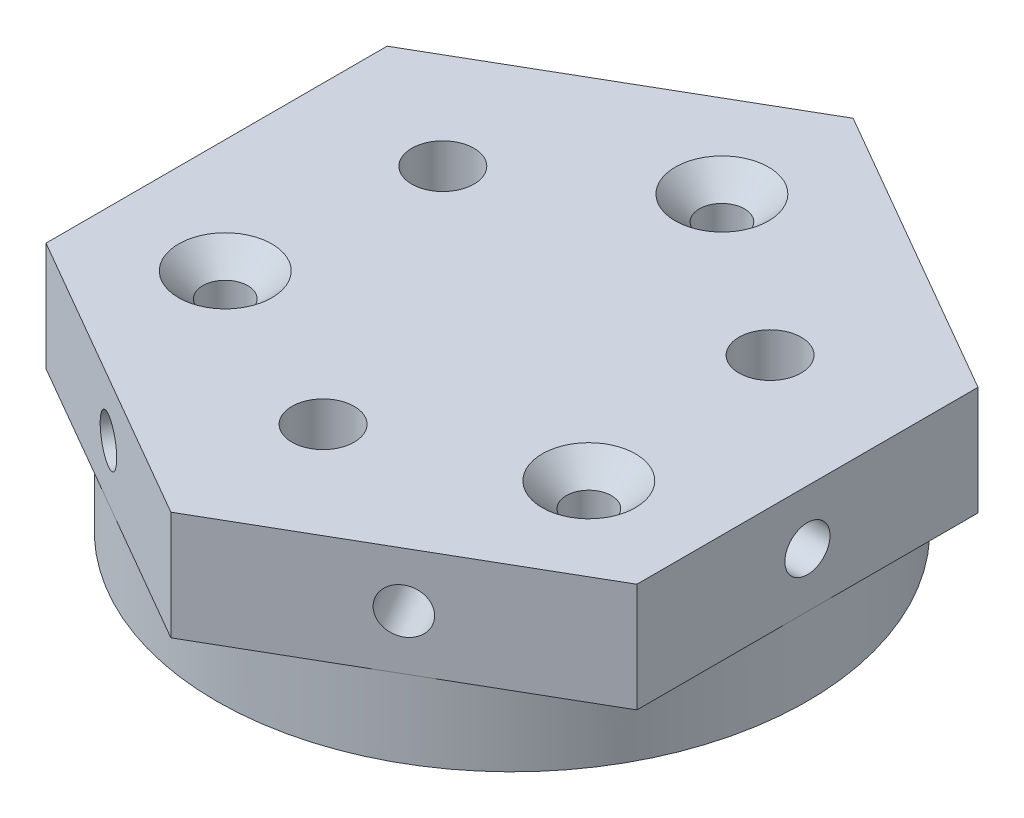
ISO-10303-21;
HEADER;
FILE_DESCRIPTION(('STEP AP214'),'2;1');
FILE_NAME('part.step','',(''),(''),'','','');
FILE_SCHEMA(('AUTOMOTIVE_DESIGN { 1 0 10303 214 1 1 1 1 }'));
ENDSEC;
DATA;
#1=APPLICATION_CONTEXT('core data for automotive mechanical design processes');
#2=APPLICATION_PROTOCOL_DEFINITION('international standard','automotive_design',2000,#1);
#3=PRODUCT_CONTEXT('',#1,'mechanical');
#4=PRODUCT('Part','Part','',(#3));
#5=PRODUCT_RELATED_PRODUCT_CATEGORY('part','',(#4));
#6=PRODUCT_DEFINITION_FORMATION('','',#4);
#7=PRODUCT_DEFINITION_CONTEXT('part definition',#1,'design');
#8=PRODUCT_DEFINITION('design','',#6,#7);
#9=PRODUCT_DEFINITION_SHAPE('','',#8);
#10=(LENGTH_UNIT() NAMED_UNIT(*) SI_UNIT(.MILLI.,.METRE.));
#11=(NAMED_UNIT(*) PLANE_ANGLE_UNIT() SI_UNIT($,.RADIAN.));
#12=(NAMED_UNIT(*) SI_UNIT($,.STERADIAN.) SOLID_ANGLE_UNIT());
#13=UNCERTAINTY_MEASURE_WITH_UNIT(LENGTH_MEASURE(1.E-05),#10,'distance_accuracy_value','');
#14=(GEOMETRIC_REPRESENTATION_CONTEXT(3) GLOBAL_UNCERTAINTY_ASSIGNED_CONTEXT((#13)) GLOBAL_UNIT_ASSIGNED_CONTEXT((#10,
#11,#12)) REPRESENTATION_CONTEXT('',''));
#15=CARTESIAN_POINT('',(0.,0.,0.));
#16=DIRECTION('',(0.,0.,1.));
#17=DIRECTION('',(1.,0.,0.));
#18=AXIS2_PLACEMENT_3D('',#15,#16,#17);
#19=CARTESIAN_POINT('',(-14.25,8.5,-24.6817240078565));
#20=DIRECTION('',(0.500000000000001,0.,0.866025403784438));
#21=DIRECTION('',(0.866025403784438,0.,-0.500000000000001));
#22=AXIS2_PLACEMENT_3D('',#19,#20,#21);
#23=CYLINDRICAL_SURFACE('',#22,1.45);
#24=CARTESIAN_POINT('',(9.50000000000001,8.5,16.4544826719043));
#25=DIRECTION('',(0.5,0.,0.866025403784438));
#26=DIRECTION('',(0.866025403784438,0.,-0.5));
#27=AXIS2_PLACEMENT_3D('',#24,#25,#26);
#28=CIRCLE('',#27,1.45);
#29=CARTESIAN_POINT('',(10.7557368354874,8.5,15.7294826719043));
#30=VERTEX_POINT('',#29);
#31=EDGE_CURVE('E169',#30,#30,#28,.T.);
#32=ORIENTED_EDGE('',*,*,#31,.T.);
#33=EDGE_LOOP('',(#32));
#34=FACE_BOUND('',#33,.T.);
#35=CARTESIAN_POINT('',(0.,8.5,0.));
#36=DIRECTION('',(1.,0.,0.));
#37=DIRECTION('',(0.,0.,1.));
#38=AXIS2_PLACEMENT_3D('',#35,#36,#37);
#39=ELLIPSE('',#38,2.9,1.45);
#40=CARTESIAN_POINT('',(0.,7.05,0.));
#41=VERTEX_POINT('',#40);
#42=CARTESIAN_POINT('',(0.,9.95,0.));
#43=VERTEX_POINT('',#42);
#44=EDGE_CURVE('E146',#41,#43,#39,.F.);
#45=ORIENTED_EDGE('',*,*,#44,.T.);
#46=CARTESIAN_POINT('',(0.,8.5,0.));
#47=DIRECTION('',(-0.5,0.,0.866025403784439));
#48=DIRECTION('',(0.866025403784439,0.,0.5));
#49=AXIS2_PLACEMENT_3D('',#46,#47,#48);
#50=ELLIPSE('',#49,2.9,1.45);
#51=EDGE_CURVE('E134',#43,#41,#50,.F.);
#52=ORIENTED_EDGE('',*,*,#51,.T.);
#53=EDGE_LOOP('',(#45,#52));
#54=FACE_BOUND('',#53,.T.);
#55=ADVANCED_FACE('F40',(#34,#54),#23,.F.);
#56=CARTESIAN_POINT('',(0.,12.,0.));
#57=DIRECTION('',(0.,-1.,0.));
#58=DIRECTION('',(0.,0.,-1.));
#59=AXIS2_PLACEMENT_3D('',#56,#57,#58);
#60=CYLINDRICAL_SURFACE('',#59,19.);
#61=CARTESIAN_POINT('',(0.,0.,0.));
#62=DIRECTION('',(0.,1.,0.));
#63=DIRECTION('',(0.,0.,1.));
#64=AXIS2_PLACEMENT_3D('',#61,#62,#63);
#65=CIRCLE('',#64,19.);
#66=CARTESIAN_POINT('',(0.,0.,19.));
#67=VERTEX_POINT('',#66);
#68=EDGE_CURVE('E151',#67,#67,#65,.T.);
#69=ORIENTED_EDGE('',*,*,#68,.T.);
#70=EDGE_LOOP('',(#69));
#71=FACE_BOUND('',#70,.T.);
#72=CARTESIAN_POINT('',(0.,5.,0.));
#73=DIRECTION('',(0.,1.,0.));
#74=DIRECTION('',(0.,0.,1.));
#75=AXIS2_PLACEMENT_3D('',#72,#73,#74);
#76=CIRCLE('',#75,19.);
#77=CARTESIAN_POINT('',(9.50000000000001,5.,16.4544826719043));
#78=VERTEX_POINT('',#77);
#79=CARTESIAN_POINT('',(19.,5.,0.));
#80=VERTEX_POINT('',#79);
#81=EDGE_CURVE('E251',#78,#80,#76,.T.);
#82=ORIENTED_EDGE('',*,*,#81,.F.);
#83=CARTESIAN_POINT('',(-9.50000000000001,5.,16.4544826719043));
#84=VERTEX_POINT('',#83);
#85=EDGE_CURVE('E227',#84,#78,#76,.T.);
#86=ORIENTED_EDGE('',*,*,#85,.F.);
#87=CARTESIAN_POINT('',(-19.,5.,0.));
#88=VERTEX_POINT('',#87);
#89=EDGE_CURVE('E250',#88,#84,#76,.T.);
#90=ORIENTED_EDGE('',*,*,#89,.F.);
#91=CARTESIAN_POINT('',(-9.5,5.,-16.4544826719043));
#92=VERTEX_POINT('',#91);
#93=EDGE_CURVE('E385',#92,#88,#76,.T.);
#94=ORIENTED_EDGE('',*,*,#93,.F.);
#95=CARTESIAN_POINT('',(9.5,5.,-16.4544826719043));
#96=VERTEX_POINT('',#95);
#97=EDGE_CURVE('E387',#96,#92,#76,.T.);
#98=ORIENTED_EDGE('',*,*,#97,.F.);
#99=EDGE_CURVE('E64',#80,#96,#76,.T.);
#100=ORIENTED_EDGE('',*,*,#99,.F.);
#101=EDGE_LOOP('',(#82,#86,#90,#94,#98,#100));
#102=FACE_BOUND('',#101,.T.);
#103=ADVANCED_FACE('F329',(#71,#102),#60,.T.);
#104=CARTESIAN_POINT('',(0.,12.,0.));
#105=DIRECTION('',(0.,1.,0.));
#106=DIRECTION('',(0.,0.,1.));
#107=AXIS2_PLACEMENT_3D('',#104,#105,#106);
#108=PLANE('',#107);
#109=CARTESIAN_POINT('',(0.,12.,-13.5));
#110=DIRECTION('',(0.,1.,0.));
#111=DIRECTION('',(0.,0.,1.));
#112=AXIS2_PLACEMENT_3D('',#109,#110,#111);
#113=CIRCLE('',#112,3.00000000000001);
#114=CARTESIAN_POINT('',(0.,12.,-10.5));
#115=VERTEX_POINT('',#114);
#116=EDGE_CURVE('E305',#115,#115,#113,.F.);
#117=ORIENTED_EDGE('',*,*,#116,.T.);
#118=EDGE_LOOP('',(#117));
#119=FACE_BOUND('',#118,.T.);
#120=CARTESIAN_POINT('',(-11.6913429510899,12.,6.74999999999997));
#121=DIRECTION('',(0.,1.,0.));
#122=DIRECTION('',(0.,0.,1.));
#123=AXIS2_PLACEMENT_3D('',#120,#121,#122);
#124=CIRCLE('',#123,3.00000000000001);
#125=CARTESIAN_POINT('',(-11.6913429510899,12.,9.74999999999998));
#126=VERTEX_POINT('',#125);
#127=EDGE_CURVE('E301',#126,#126,#124,.F.);
#128=ORIENTED_EDGE('',*,*,#127,.T.);
#129=EDGE_LOOP('',(#128));
#130=FACE_BOUND('',#129,.T.);
#131=CARTESIAN_POINT('',(11.6913429510899,12.,6.75000000000006));
#132=DIRECTION('',(0.,1.,0.));
#133=DIRECTION('',(0.,0.,1.));
#134=AXIS2_PLACEMENT_3D('',#131,#132,#133);
#135=CIRCLE('',#134,2.99999999999999);
#136=CARTESIAN_POINT('',(11.6913429510899,12.,9.75000000000004));
#137=VERTEX_POINT('',#136);
#138=EDGE_CURVE('E297',#137,#137,#135,.F.);
#139=ORIENTED_EDGE('',*,*,#138,.T.);
#140=EDGE_LOOP('',(#139));
#141=FACE_BOUND('',#140,.T.);
#142=CARTESIAN_POINT('',(0.,12.,12.15));
#143=DIRECTION('',(0.,1.,0.));
#144=DIRECTION('',(0.,0.,1.));
#145=AXIS2_PLACEMENT_3D('',#142,#143,#144);
#146=CIRCLE('',#145,2.);
#147=CARTESIAN_POINT('',(0.,12.,14.15));
#148=VERTEX_POINT('',#147);
#149=EDGE_CURVE('E261',#148,#148,#146,.T.);
#150=ORIENTED_EDGE('',*,*,#149,.F.);
#151=EDGE_LOOP('',(#150));
#152=FACE_BOUND('',#151,.T.);
#153=DIRECTION('',(0.866025403784438,0.,0.5));
#154=VECTOR('',#153,1.);
#155=CARTESIAN_POINT('',(-19.,12.,10.9696551146029));
#156=LINE('',#155,#154);
#157=CARTESIAN_POINT('',(-19.,12.,10.9696551146029));
#158=VERTEX_POINT('',#157);
#159=CARTESIAN_POINT('',(0.,12.,21.9393102292058));
#160=VERTEX_POINT('',#159);
#161=EDGE_CURVE('E214',#158,#160,#156,.T.);
#162=ORIENTED_EDGE('',*,*,#161,.T.);
#163=DIRECTION('',(0.866025403784438,0.,-0.5));
#164=VECTOR('',#163,1.);
#165=CARTESIAN_POINT('',(0.,12.,21.9393102292058));
#166=LINE('',#165,#164);
#167=CARTESIAN_POINT('',(19.,12.,10.9696551146029));
#168=VERTEX_POINT('',#167);
#169=EDGE_CURVE('E217',#160,#168,#166,.T.);
#170=ORIENTED_EDGE('',*,*,#169,.T.);
#171=DIRECTION('',(0.,0.,-1.));
#172=VECTOR('',#171,1.);
#173=CARTESIAN_POINT('',(19.,12.,10.9696551146029));
#174=LINE('',#173,#172);
#175=CARTESIAN_POINT('',(19.,12.,-10.9696551146029));
#176=VERTEX_POINT('',#175);
#177=EDGE_CURVE('E220',#168,#176,#174,.T.);
#178=ORIENTED_EDGE('',*,*,#177,.T.);
#179=DIRECTION('',(-0.866025403784439,0.,-0.5));
#180=VECTOR('',#179,1.);
#181=CARTESIAN_POINT('',(19.,12.,-10.9696551146029));
#182=LINE('',#181,#180);
#183=CARTESIAN_POINT('',(0.,12.,-21.9393102292058));
#184=VERTEX_POINT('',#183);
#185=EDGE_CURVE('E205',#176,#184,#182,.T.);
#186=ORIENTED_EDGE('',*,*,#185,.T.);
#187=DIRECTION('',(-0.866025403784439,0.,0.5));
#188=VECTOR('',#187,1.);
#189=CARTESIAN_POINT('',(0.,12.,-21.9393102292058));
#190=LINE('',#189,#188);
#191=CARTESIAN_POINT('',(-19.,12.,-10.9696551146029));
#192=VERTEX_POINT('',#191);
#193=EDGE_CURVE('E208',#184,#192,#190,.T.);
#194=ORIENTED_EDGE('',*,*,#193,.T.);
#195=DIRECTION('',(0.,0.,1.));
#196=VECTOR('',#195,1.);
#197=CARTESIAN_POINT('',(-19.,12.,-10.9696551146029));
#198=LINE('',#197,#196);
#199=EDGE_CURVE('E211',#192,#158,#198,.T.);
#200=ORIENTED_EDGE('',*,*,#199,.T.);
#201=EDGE_LOOP('',(#162,#170,#178,#186,#194,#200));
#202=FACE_BOUND('',#201,.T.);
#203=CARTESIAN_POINT('',(-10.5222086559809,12.,-6.07499999999997));
#204=DIRECTION('',(0.,1.,0.));
#205=DIRECTION('',(0.,0.,1.));
#206=AXIS2_PLACEMENT_3D('',#203,#204,#205);
#207=CIRCLE('',#206,2.);
#208=CARTESIAN_POINT('',(-10.5222086559809,12.,-4.07499999999997));
#209=VERTEX_POINT('',#208);
#210=EDGE_CURVE('E269',#209,#209,#207,.T.);
#211=ORIENTED_EDGE('',*,*,#210,.F.);
#212=EDGE_LOOP('',(#211));
#213=FACE_BOUND('',#212,.T.);
#214=CARTESIAN_POINT('',(10.5222086559809,12.,-6.07500000000005));
#215=DIRECTION('',(0.,1.,0.));
#216=DIRECTION('',(0.,0.,1.));
#217=AXIS2_PLACEMENT_3D('',#214,#215,#216);
#218=CIRCLE('',#217,2.);
#219=CARTESIAN_POINT('',(10.5222086559809,12.,-4.07500000000005));
#220=VERTEX_POINT('',#219);
#221=EDGE_CURVE('E252',#220,#220,#218,.T.);
#222=ORIENTED_EDGE('',*,*,#221,.F.);
#223=EDGE_LOOP('',(#222));
#224=FACE_BOUND('',#223,.T.);
#225=ADVANCED_FACE('F335',(#119,#130,#141,#152,#202,#213,#224),#108,.T.);
#226=CARTESIAN_POINT('',(0.,0.,0.));
#227=DIRECTION('',(0.,1.,0.));
#228=DIRECTION('',(0.,0.,1.));
#229=AXIS2_PLACEMENT_3D('',#226,#227,#228);
#230=PLANE('',#229);
#231=ORIENTED_EDGE('',*,*,#68,.F.);
#232=EDGE_LOOP('',(#231));
#233=FACE_BOUND('',#232,.T.);
#234=CARTESIAN_POINT('',(0.,0.,-13.5));
#235=DIRECTION('',(0.,1.,0.));
#236=DIRECTION('',(0.,0.,1.));
#237=AXIS2_PLACEMENT_3D('',#234,#235,#236);
#238=CIRCLE('',#237,1.45);
#239=CARTESIAN_POINT('',(0.,0.,-12.05));
#240=VERTEX_POINT('',#239);
#241=EDGE_CURVE('E284',#240,#240,#238,.T.);
#242=ORIENTED_EDGE('',*,*,#241,.T.);
#243=EDGE_LOOP('',(#242));
#244=FACE_BOUND('',#243,.T.);
#245=CARTESIAN_POINT('',(-11.6913429510899,0.,6.74999999999997));
#246=DIRECTION('',(0.,1.,0.));
#247=DIRECTION('',(0.,0.,1.));
#248=AXIS2_PLACEMENT_3D('',#245,#246,#247);
#249=CIRCLE('',#248,1.45);
#250=CARTESIAN_POINT('',(-11.6913429510899,0.,8.19999999999997));
#251=VERTEX_POINT('',#250);
#252=EDGE_CURVE('E280',#251,#251,#249,.T.);
#253=ORIENTED_EDGE('',*,*,#252,.T.);
#254=EDGE_LOOP('',(#253));
#255=FACE_BOUND('',#254,.T.);
#256=CARTESIAN_POINT('',(11.6913429510899,0.,6.75000000000006));
#257=DIRECTION('',(0.,1.,0.));
#258=DIRECTION('',(0.,0.,1.));
#259=AXIS2_PLACEMENT_3D('',#256,#257,#258);
#260=CIRCLE('',#259,1.45);
#261=CARTESIAN_POINT('',(11.6913429510899,0.,8.20000000000006));
#262=VERTEX_POINT('',#261);
#263=EDGE_CURVE('E273',#262,#262,#260,.T.);
#264=ORIENTED_EDGE('',*,*,#263,.T.);
#265=EDGE_LOOP('',(#264));
#266=FACE_BOUND('',#265,.T.);
#267=CARTESIAN_POINT('',(-10.5222086559809,0.,-6.07499999999997));
#268=DIRECTION('',(0.,1.,0.));
#269=DIRECTION('',(0.,0.,1.));
#270=AXIS2_PLACEMENT_3D('',#267,#268,#269);
#271=CIRCLE('',#270,2.);
#272=CARTESIAN_POINT('',(-10.5222086559809,0.,-4.07499999999997));
#273=VERTEX_POINT('',#272);
#274=EDGE_CURVE('E265',#273,#273,#271,.T.);
#275=ORIENTED_EDGE('',*,*,#274,.T.);
#276=EDGE_LOOP('',(#275));
#277=FACE_BOUND('',#276,.T.);
#278=CARTESIAN_POINT('',(0.,0.,12.15));
#279=DIRECTION('',(0.,1.,0.));
#280=DIRECTION('',(0.,0.,1.));
#281=AXIS2_PLACEMENT_3D('',#278,#279,#280);
#282=CIRCLE('',#281,2.);
#283=CARTESIAN_POINT('',(0.,0.,14.15));
#284=VERTEX_POINT('',#283);
#285=EDGE_CURVE('E256',#284,#284,#282,.T.);
#286=ORIENTED_EDGE('',*,*,#285,.T.);
#287=EDGE_LOOP('',(#286));
#288=FACE_BOUND('',#287,.T.);
#289=CARTESIAN_POINT('',(10.5222086559809,0.,-6.07500000000005));
#290=DIRECTION('',(0.,1.,0.));
#291=DIRECTION('',(0.,0.,1.));
#292=AXIS2_PLACEMENT_3D('',#289,#290,#291);
#293=CIRCLE('',#292,2.);
#294=CARTESIAN_POINT('',(10.5222086559809,0.,-4.07500000000005));
#295=VERTEX_POINT('',#294);
#296=EDGE_CURVE('E257',#295,#295,#293,.T.);
#297=ORIENTED_EDGE('',*,*,#296,.T.);
#298=EDGE_LOOP('',(#297));
#299=FACE_BOUND('',#298,.T.);
#300=ADVANCED_FACE('F470',(#233,#244,#255,#266,#277,#288,#299),#230,.F.);
#301=CARTESIAN_POINT('',(0.,12.,-13.5));
#302=DIRECTION('',(0.,-1.,0.));
#303=DIRECTION('',(0.,0.,-1.));
#304=AXIS2_PLACEMENT_3D('',#301,#302,#303);
#305=CYLINDRICAL_SURFACE('',#304,1.45);
#306=CARTESIAN_POINT('',(0.,10.45,-13.5));
#307=DIRECTION('',(0.,1.,0.));
#308=DIRECTION('',(0.,0.,1.));
#309=AXIS2_PLACEMENT_3D('',#306,#307,#308);
#310=CIRCLE('',#309,1.45);
#311=CARTESIAN_POINT('',(0.,10.45,-12.05));
#312=VERTEX_POINT('',#311);
#313=EDGE_CURVE('E145',#312,#312,#310,.T.);
#314=ORIENTED_EDGE('',*,*,#313,.T.);
#315=EDGE_LOOP('',(#314));
#316=FACE_BOUND('',#315,.T.);
#317=ORIENTED_EDGE('',*,*,#241,.F.);
#318=EDGE_LOOP('',(#317));
#319=FACE_BOUND('',#318,.T.);
#320=ADVANCED_FACE('F467',(#316,#319),#305,.F.);
#321=CARTESIAN_POINT('',(-11.6913429510899,12.,6.74999999999997));
#322=DIRECTION('',(0.,-1.,0.));
#323=DIRECTION('',(0.,0.,-1.));
#324=AXIS2_PLACEMENT_3D('',#321,#322,#323);
#325=CYLINDRICAL_SURFACE('',#324,1.45);
#326=CARTESIAN_POINT('',(-11.6913429510899,10.45,6.74999999999997));
#327=DIRECTION('',(0.,1.,0.));
#328=DIRECTION('',(0.,0.,1.));
#329=AXIS2_PLACEMENT_3D('',#326,#327,#328);
#330=CIRCLE('',#329,1.45);
#331=CARTESIAN_POINT('',(-11.6913429510899,10.45,8.19999999999997));
#332=VERTEX_POINT('',#331);
#333=EDGE_CURVE('E50',#332,#332,#330,.T.);
#334=ORIENTED_EDGE('',*,*,#333,.T.);
#335=EDGE_LOOP('',(#334));
#336=FACE_BOUND('',#335,.T.);
#337=ORIENTED_EDGE('',*,*,#252,.F.);
#338=EDGE_LOOP('',(#337));
#339=FACE_BOUND('',#338,.T.);
#340=ADVANCED_FACE('F312',(#336,#339),#325,.F.);
#341=CARTESIAN_POINT('',(11.6913429510899,12.,6.75000000000006));
#342=DIRECTION('',(0.,-1.,0.));
#343=DIRECTION('',(0.,0.,-1.));
#344=AXIS2_PLACEMENT_3D('',#341,#342,#343);
#345=CYLINDRICAL_SURFACE('',#344,1.45);
#346=CARTESIAN_POINT('',(11.6913429510899,10.45,6.75000000000006));
#347=DIRECTION('',(0.,1.,0.));
#348=DIRECTION('',(0.,0.,1.));
#349=AXIS2_PLACEMENT_3D('',#346,#347,#348);
#350=CIRCLE('',#349,1.45);
#351=CARTESIAN_POINT('',(11.6913429510899,10.45,8.20000000000006));
#352=VERTEX_POINT('',#351);
#353=EDGE_CURVE('E11',#352,#352,#350,.T.);
#354=ORIENTED_EDGE('',*,*,#353,.T.);
#355=EDGE_LOOP('',(#354));
#356=FACE_BOUND('',#355,.T.);
#357=ORIENTED_EDGE('',*,*,#263,.F.);
#358=EDGE_LOOP('',(#357));
#359=FACE_BOUND('',#358,.T.);
#360=ADVANCED_FACE('F460',(#356,#359),#345,.F.);
#361=CARTESIAN_POINT('',(-10.5222086559809,12.,-6.07499999999997));
#362=DIRECTION('',(0.,-1.,0.));
#363=DIRECTION('',(0.,0.,-1.));
#364=AXIS2_PLACEMENT_3D('',#361,#362,#363);
#365=CYLINDRICAL_SURFACE('',#364,2.);
#366=ORIENTED_EDGE('',*,*,#210,.T.);
#367=EDGE_LOOP('',(#366));
#368=FACE_BOUND('',#367,.T.);
#369=ORIENTED_EDGE('',*,*,#274,.F.);
#370=EDGE_LOOP('',(#369));
#371=FACE_BOUND('',#370,.T.);
#372=ADVANCED_FACE('F456',(#368,#371),#365,.F.);
#373=CARTESIAN_POINT('',(0.,12.,12.15));
#374=DIRECTION('',(0.,-1.,0.));
#375=DIRECTION('',(0.,0.,-1.));
#376=AXIS2_PLACEMENT_3D('',#373,#374,#375);
#377=CYLINDRICAL_SURFACE('',#376,2.);
#378=ORIENTED_EDGE('',*,*,#149,.T.);
#379=EDGE_LOOP('',(#378));
#380=FACE_BOUND('',#379,.T.);
#381=ORIENTED_EDGE('',*,*,#285,.F.);
#382=EDGE_LOOP('',(#381));
#383=FACE_BOUND('',#382,.T.);
#384=ADVANCED_FACE('F452',(#380,#383),#377,.F.);
#385=CARTESIAN_POINT('',(10.5222086559809,12.,-6.07500000000005));
#386=DIRECTION('',(0.,-1.,0.));
#387=DIRECTION('',(0.,0.,-1.));
#388=AXIS2_PLACEMENT_3D('',#385,#386,#387);
#389=CYLINDRICAL_SURFACE('',#388,2.);
#390=ORIENTED_EDGE('',*,*,#221,.T.);
#391=EDGE_LOOP('',(#390));
#392=FACE_BOUND('',#391,.T.);
#393=ORIENTED_EDGE('',*,*,#296,.F.);
#394=EDGE_LOOP('',(#393));
#395=FACE_BOUND('',#394,.T.);
#396=ADVANCED_FACE('F440',(#392,#395),#389,.F.);
#397=CARTESIAN_POINT('',(19.,5.,-10.9696551146029));
#398=DIRECTION('',(0.5,0.,-0.866025403784439));
#399=DIRECTION('',(-0.866025403784439,0.,-0.5));
#400=AXIS2_PLACEMENT_3D('',#397,#398,#399);
#401=PLANE('',#400);
#402=CARTESIAN_POINT('',(9.50000000000002,8.5,-16.4544826719043));
#403=DIRECTION('',(0.5,0.,-0.866025403784439));
#404=DIRECTION('',(-0.866025403784439,0.,-0.5));
#405=AXIS2_PLACEMENT_3D('',#402,#403,#404);
#406=CIRCLE('',#405,1.45);
#407=CARTESIAN_POINT('',(8.24426316451258,8.5,-17.1794826719043));
#408=VERTEX_POINT('',#407);
#409=EDGE_CURVE('E165',#408,#408,#406,.T.);
#410=ORIENTED_EDGE('',*,*,#409,.F.);
#411=EDGE_LOOP('',(#410));
#412=FACE_BOUND('',#411,.T.);
#413=DIRECTION('',(-0.866025403784439,0.,-0.5));
#414=VECTOR('',#413,1.);
#415=CARTESIAN_POINT('',(19.,5.,-10.9696551146029));
#416=LINE('',#415,#414);
#417=CARTESIAN_POINT('',(19.,5.,-10.9696551146029));
#418=VERTEX_POINT('',#417);
#419=EDGE_CURVE('E174',#418,#96,#416,.T.);
#420=ORIENTED_EDGE('',*,*,#419,.T.);
#421=CARTESIAN_POINT('',(0.,5.,-21.9393102292058));
#422=VERTEX_POINT('',#421);
#423=EDGE_CURVE('E179',#96,#422,#416,.T.);
#424=ORIENTED_EDGE('',*,*,#423,.T.);
#425=DIRECTION('',(0.,1.,0.));
#426=VECTOR('',#425,1.);
#427=CARTESIAN_POINT('',(0.,5.,-21.9393102292058));
#428=LINE('',#427,#426);
#429=EDGE_CURVE('E204',#422,#184,#428,.T.);
#430=ORIENTED_EDGE('',*,*,#429,.T.);
#431=ORIENTED_EDGE('',*,*,#185,.F.);
#432=DIRECTION('',(0.,1.,0.));
#433=VECTOR('',#432,1.);
#434=CARTESIAN_POINT('',(19.,5.,-10.9696551146029));
#435=LINE('',#434,#433);
#436=EDGE_CURVE('E223',#418,#176,#435,.T.);
#437=ORIENTED_EDGE('',*,*,#436,.F.);
#438=EDGE_LOOP('',(#420,#424,#430,#431,#437));
#439=FACE_BOUND('',#438,.T.);
#440=ADVANCED_FACE('F414',(#412,#439),#401,.T.);
#441=CARTESIAN_POINT('',(19.,5.,10.9696551146029));
#442=DIRECTION('',(1.,0.,0.));
#443=DIRECTION('',(0.,0.,-1.));
#444=AXIS2_PLACEMENT_3D('',#441,#442,#443);
#445=PLANE('',#444);
#446=CARTESIAN_POINT('',(19.,8.5,0.));
#447=DIRECTION('',(1.,0.,0.));
#448=DIRECTION('',(0.,0.,-1.));
#449=AXIS2_PLACEMENT_3D('',#446,#447,#448);
#450=CIRCLE('',#449,1.45);
#451=CARTESIAN_POINT('',(19.,8.5,-1.45));
#452=VERTEX_POINT('',#451);
#453=EDGE_CURVE('E137',#452,#452,#450,.T.);
#454=ORIENTED_EDGE('',*,*,#453,.F.);
#455=EDGE_LOOP('',(#454));
#456=FACE_BOUND('',#455,.T.);
#457=DIRECTION('',(0.,0.,-1.));
#458=VECTOR('',#457,1.);
#459=CARTESIAN_POINT('',(19.,5.,10.9696551146029));
#460=LINE('',#459,#458);
#461=CARTESIAN_POINT('',(19.,5.,10.9696551146029));
#462=VERTEX_POINT('',#461);
#463=EDGE_CURVE('E200',#462,#80,#460,.T.);
#464=ORIENTED_EDGE('',*,*,#463,.T.);
#465=EDGE_CURVE('E199',#80,#418,#460,.T.);
#466=ORIENTED_EDGE('',*,*,#465,.T.);
#467=ORIENTED_EDGE('',*,*,#436,.T.);
#468=ORIENTED_EDGE('',*,*,#177,.F.);
#469=DIRECTION('',(0.,1.,0.));
#470=VECTOR('',#469,1.);
#471=CARTESIAN_POINT('',(19.,5.,10.9696551146029));
#472=LINE('',#471,#470);
#473=EDGE_CURVE('E228',#462,#168,#472,.T.);
#474=ORIENTED_EDGE('',*,*,#473,.F.);
#475=EDGE_LOOP('',(#464,#466,#467,#468,#474));
#476=FACE_BOUND('',#475,.T.);
#477=ADVANCED_FACE('F418',(#456,#476),#445,.T.);
#478=CARTESIAN_POINT('',(0.,5.,21.9393102292058));
#479=DIRECTION('',(0.5,0.,0.866025403784438));
#480=DIRECTION('',(0.866025403784438,0.,-0.5));
#481=AXIS2_PLACEMENT_3D('',#478,#479,#480);
#482=PLANE('',#481);
#483=ORIENTED_EDGE('',*,*,#31,.F.);
#484=EDGE_LOOP('',(#483));
#485=FACE_BOUND('',#484,.T.);
#486=DIRECTION('',(0.866025403784438,0.,-0.5));
#487=VECTOR('',#486,1.);
#488=CARTESIAN_POINT('',(0.,5.,21.9393102292058));
#489=LINE('',#488,#487);
#490=CARTESIAN_POINT('',(0.,5.,21.9393102292058));
#491=VERTEX_POINT('',#490);
#492=EDGE_CURVE('E195',#491,#78,#489,.T.);
#493=ORIENTED_EDGE('',*,*,#492,.T.);
#494=EDGE_CURVE('E194',#78,#462,#489,.T.);
#495=ORIENTED_EDGE('',*,*,#494,.T.);
#496=ORIENTED_EDGE('',*,*,#473,.T.);
#497=ORIENTED_EDGE('',*,*,#169,.F.);
#498=DIRECTION('',(0.,1.,0.));
#499=VECTOR('',#498,1.);
#500=CARTESIAN_POINT('',(0.,5.,21.9393102292058));
#501=LINE('',#500,#499);
#502=EDGE_CURVE('E232',#491,#160,#501,.T.);
#503=ORIENTED_EDGE('',*,*,#502,.F.);
#504=EDGE_LOOP('',(#493,#495,#496,#497,#503));
#505=FACE_BOUND('',#504,.T.);
#506=ADVANCED_FACE('F378',(#485,#505),#482,.T.);
#507=CARTESIAN_POINT('',(-19.,5.,10.9696551146029));
#508=DIRECTION('',(-0.5,0.,0.866025403784438));
#509=DIRECTION('',(0.866025403784438,0.,0.5));
#510=AXIS2_PLACEMENT_3D('',#507,#508,#509);
#511=PLANE('',#510);
#512=CARTESIAN_POINT('',(-9.5,8.5,16.4544826719043));
#513=DIRECTION('',(-0.5,0.,0.866025403784438));
#514=DIRECTION('',(0.866025403784439,0.,0.5));
#515=AXIS2_PLACEMENT_3D('',#512,#513,#514);
#516=CIRCLE('',#515,1.45);
#517=CARTESIAN_POINT('',(-8.24426316451257,8.5,17.1794826719043));
#518=VERTEX_POINT('',#517);
#519=EDGE_CURVE('E159',#518,#518,#516,.T.);
#520=ORIENTED_EDGE('',*,*,#519,.F.);
#521=EDGE_LOOP('',(#520));
#522=FACE_BOUND('',#521,.T.);
#523=DIRECTION('',(0.866025403784438,0.,0.5));
#524=VECTOR('',#523,1.);
#525=CARTESIAN_POINT('',(-19.,5.,10.9696551146029));
#526=LINE('',#525,#524);
#527=CARTESIAN_POINT('',(-19.,5.,10.9696551146029));
#528=VERTEX_POINT('',#527);
#529=EDGE_CURVE('E190',#528,#84,#526,.T.);
#530=ORIENTED_EDGE('',*,*,#529,.T.);
#531=EDGE_CURVE('E189',#84,#491,#526,.T.);
#532=ORIENTED_EDGE('',*,*,#531,.T.);
#533=ORIENTED_EDGE('',*,*,#502,.T.);
#534=ORIENTED_EDGE('',*,*,#161,.F.);
#535=DIRECTION('',(0.,1.,0.));
#536=VECTOR('',#535,1.);
#537=CARTESIAN_POINT('',(-19.,5.,10.9696551146029));
#538=LINE('',#537,#536);
#539=EDGE_CURVE('E236',#528,#158,#538,.T.);
#540=ORIENTED_EDGE('',*,*,#539,.F.);
#541=EDGE_LOOP('',(#530,#532,#533,#534,#540));
#542=FACE_BOUND('',#541,.T.);
#543=ADVANCED_FACE('F423',(#522,#542),#511,.T.);
#544=CARTESIAN_POINT('',(-19.,5.,-10.9696551146029));
#545=DIRECTION('',(-1.,0.,0.));
#546=DIRECTION('',(0.,0.,1.));
#547=AXIS2_PLACEMENT_3D('',#544,#545,#546);
#548=PLANE('',#547);
#549=CARTESIAN_POINT('',(-19.,8.5,0.));
#550=DIRECTION('',(-1.,0.,0.));
#551=DIRECTION('',(0.,0.,1.));
#552=AXIS2_PLACEMENT_3D('',#549,#550,#551);
#553=CIRCLE('',#552,1.45);
#554=CARTESIAN_POINT('',(-19.,8.5,1.45));
#555=VERTEX_POINT('',#554);
#556=EDGE_CURVE('E154',#555,#555,#553,.T.);
#557=ORIENTED_EDGE('',*,*,#556,.F.);
#558=EDGE_LOOP('',(#557));
#559=FACE_BOUND('',#558,.T.);
#560=DIRECTION('',(0.,0.,1.));
#561=VECTOR('',#560,1.);
#562=CARTESIAN_POINT('',(-19.,5.,-10.9696551146029));
#563=LINE('',#562,#561);
#564=CARTESIAN_POINT('',(-19.,5.,-10.9696551146029));
#565=VERTEX_POINT('',#564);
#566=EDGE_CURVE('E185',#565,#88,#563,.T.);
#567=ORIENTED_EDGE('',*,*,#566,.T.);
#568=EDGE_CURVE('E184',#88,#528,#563,.T.);
#569=ORIENTED_EDGE('',*,*,#568,.T.);
#570=ORIENTED_EDGE('',*,*,#539,.T.);
#571=ORIENTED_EDGE('',*,*,#199,.F.);
#572=DIRECTION('',(0.,1.,0.));
#573=VECTOR('',#572,1.);
#574=CARTESIAN_POINT('',(-19.,5.,-10.9696551146029));
#575=LINE('',#574,#573);
#576=EDGE_CURVE('E240',#565,#192,#575,.T.);
#577=ORIENTED_EDGE('',*,*,#576,.F.);
#578=EDGE_LOOP('',(#567,#569,#570,#571,#577));
#579=FACE_BOUND('',#578,.T.);
#580=ADVANCED_FACE('F367',(#559,#579),#548,.T.);
#581=CARTESIAN_POINT('',(0.,5.,-21.9393102292058));
#582=DIRECTION('',(-0.5,0.,-0.866025403784439));
#583=DIRECTION('',(-0.866025403784439,0.,0.5));
#584=AXIS2_PLACEMENT_3D('',#581,#582,#583);
#585=PLANE('',#584);
#586=CARTESIAN_POINT('',(-9.50000000000001,8.5,-16.4544826719043));
#587=DIRECTION('',(-0.5,0.,-0.866025403784439));
#588=DIRECTION('',(-0.866025403784439,0.,0.5));
#589=AXIS2_PLACEMENT_3D('',#586,#587,#588);
#590=CIRCLE('',#589,1.45);
#591=CARTESIAN_POINT('',(-10.7557368354874,8.5,-15.7294826719043));
#592=VERTEX_POINT('',#591);
#593=EDGE_CURVE('E173',#592,#592,#590,.T.);
#594=ORIENTED_EDGE('',*,*,#593,.F.);
#595=EDGE_LOOP('',(#594));
#596=FACE_BOUND('',#595,.T.);
#597=DIRECTION('',(-0.866025403784439,0.,0.5));
#598=VECTOR('',#597,1.);
#599=CARTESIAN_POINT('',(0.,5.,-21.9393102292058));
#600=LINE('',#599,#598);
#601=EDGE_CURVE('E180',#422,#92,#600,.T.);
#602=ORIENTED_EDGE('',*,*,#601,.T.);
#603=EDGE_CURVE('E178',#92,#565,#600,.T.);
#604=ORIENTED_EDGE('',*,*,#603,.T.);
#605=ORIENTED_EDGE('',*,*,#576,.T.);
#606=ORIENTED_EDGE('',*,*,#193,.F.);
#607=ORIENTED_EDGE('',*,*,#429,.F.);
#608=EDGE_LOOP('',(#602,#604,#605,#606,#607));
#609=FACE_BOUND('',#608,.T.);
#610=ADVANCED_FACE('F359',(#596,#609),#585,.T.);
#611=CARTESIAN_POINT('',(0.,5.,0.));
#612=DIRECTION('',(0.,1.,0.));
#613=DIRECTION('',(0.,0.,1.));
#614=AXIS2_PLACEMENT_3D('',#611,#612,#613);
#615=PLANE('',#614);
#616=ORIENTED_EDGE('',*,*,#494,.F.);
#617=ORIENTED_EDGE('',*,*,#81,.T.);
#618=ORIENTED_EDGE('',*,*,#463,.F.);
#619=EDGE_LOOP('',(#616,#617,#618));
#620=FACE_BOUND('',#619,.T.);
#621=ADVANCED_FACE('F349',(#620),#615,.F.);
#622=ORIENTED_EDGE('',*,*,#465,.F.);
#623=ORIENTED_EDGE('',*,*,#99,.T.);
#624=ORIENTED_EDGE('',*,*,#419,.F.);
#625=EDGE_LOOP('',(#622,#623,#624));
#626=FACE_BOUND('',#625,.T.);
#627=ADVANCED_FACE('F358',(#626),#615,.F.);
#628=ORIENTED_EDGE('',*,*,#423,.F.);
#629=ORIENTED_EDGE('',*,*,#97,.T.);
#630=ORIENTED_EDGE('',*,*,#601,.F.);
#631=EDGE_LOOP('',(#628,#629,#630));
#632=FACE_BOUND('',#631,.T.);
#633=ADVANCED_FACE('F365',(#632),#615,.F.);
#634=ORIENTED_EDGE('',*,*,#603,.F.);
#635=ORIENTED_EDGE('',*,*,#93,.T.);
#636=ORIENTED_EDGE('',*,*,#566,.F.);
#637=EDGE_LOOP('',(#634,#635,#636));
#638=FACE_BOUND('',#637,.T.);
#639=ADVANCED_FACE('F353',(#638),#615,.F.);
#640=ORIENTED_EDGE('',*,*,#568,.F.);
#641=ORIENTED_EDGE('',*,*,#89,.T.);
#642=ORIENTED_EDGE('',*,*,#529,.F.);
#643=EDGE_LOOP('',(#640,#641,#642));
#644=FACE_BOUND('',#643,.T.);
#645=ADVANCED_FACE('F347',(#644),#615,.F.);
#646=ORIENTED_EDGE('',*,*,#531,.F.);
#647=ORIENTED_EDGE('',*,*,#85,.T.);
#648=ORIENTED_EDGE('',*,*,#492,.F.);
#649=EDGE_LOOP('',(#646,#647,#648));
#650=FACE_BOUND('',#649,.T.);
#651=ADVANCED_FACE('F341',(#650),#615,.F.);
#652=CARTESIAN_POINT('',(0.,8.5,0.));
#653=DIRECTION('',(1.,0.,0.));
#654=DIRECTION('',(0.,0.,1.));
#655=AXIS2_PLACEMENT_3D('',#652,#653,#654);
#656=ELLIPSE('',#655,2.9,1.45);
#657=EDGE_CURVE('E56',#41,#43,#656,.T.);
#658=ORIENTED_EDGE('',*,*,#657,.T.);
#659=CARTESIAN_POINT('',(0.,8.5,0.));
#660=DIRECTION('',(-0.5,0.,0.866025403784439));
#661=DIRECTION('',(0.866025403784439,0.,0.5));
#662=AXIS2_PLACEMENT_3D('',#659,#660,#661);
#663=ELLIPSE('',#662,2.9,1.45);
#664=EDGE_CURVE('E123',#43,#41,#663,.T.);
#665=ORIENTED_EDGE('',*,*,#664,.T.);
#666=EDGE_LOOP('',(#658,#665));
#667=FACE_BOUND('',#666,.T.);
#668=ORIENTED_EDGE('',*,*,#593,.T.);
#669=EDGE_LOOP('',(#668));
#670=FACE_BOUND('',#669,.T.);
#671=ADVANCED_FACE('F139',(#667,#670),#23,.F.);
#672=CARTESIAN_POINT('',(14.25,8.5,-24.6817240078565));
#673=DIRECTION('',(-0.5,0.,0.866025403784438));
#674=DIRECTION('',(0.866025403784438,0.,0.5));
#675=AXIS2_PLACEMENT_3D('',#672,#673,#674);
#676=CYLINDRICAL_SURFACE('',#675,1.45);
#677=ORIENTED_EDGE('',*,*,#519,.T.);
#678=EDGE_LOOP('',(#677));
#679=FACE_BOUND('',#678,.T.);
#680=ORIENTED_EDGE('',*,*,#44,.F.);
#681=CARTESIAN_POINT('',(0.,8.5,0.));
#682=DIRECTION('',(0.5,0.,0.866025403784439));
#683=DIRECTION('',(-0.866025403784439,0.,0.5));
#684=AXIS2_PLACEMENT_3D('',#681,#682,#683);
#685=ELLIPSE('',#684,2.9,1.45);
#686=EDGE_CURVE('E120',#41,#43,#685,.F.);
#687=ORIENTED_EDGE('',*,*,#686,.T.);
#688=EDGE_LOOP('',(#680,#687));
#689=FACE_BOUND('',#688,.T.);
#690=ADVANCED_FACE('F148',(#679,#689),#676,.F.);
#691=ORIENTED_EDGE('',*,*,#409,.T.);
#692=EDGE_LOOP('',(#691));
#693=FACE_BOUND('',#692,.T.);
#694=ORIENTED_EDGE('',*,*,#657,.F.);
#695=CARTESIAN_POINT('',(0.,8.5,0.));
#696=DIRECTION('',(0.5,0.,0.866025403784439));
#697=DIRECTION('',(-0.866025403784439,0.,0.5));
#698=AXIS2_PLACEMENT_3D('',#695,#696,#697);
#699=ELLIPSE('',#698,2.9,1.45);
#700=EDGE_CURVE('E128',#41,#43,#699,.T.);
#701=ORIENTED_EDGE('',*,*,#700,.T.);
#702=EDGE_LOOP('',(#694,#701));
#703=FACE_BOUND('',#702,.T.);
#704=ADVANCED_FACE('F143',(#693,#703),#676,.F.);
#705=CARTESIAN_POINT('',(-11.,8.5,0.));
#706=DIRECTION('',(-1.,0.,0.));
#707=DIRECTION('',(0.,0.,1.));
#708=AXIS2_PLACEMENT_3D('',#705,#706,#707);
#709=CYLINDRICAL_SURFACE('',#708,1.45);
#710=ORIENTED_EDGE('',*,*,#556,.T.);
#711=EDGE_LOOP('',(#710));
#712=FACE_BOUND('',#711,.T.);
#713=ORIENTED_EDGE('',*,*,#686,.F.);
#714=ORIENTED_EDGE('',*,*,#664,.F.);
#715=EDGE_LOOP('',(#713,#714));
#716=FACE_BOUND('',#715,.T.);
#717=ADVANCED_FACE('F122',(#712,#716),#709,.F.);
#718=CARTESIAN_POINT('',(-19.,8.5,0.));
#719=DIRECTION('',(1.,0.,0.));
#720=DIRECTION('',(0.,0.,-1.));
#721=AXIS2_PLACEMENT_3D('',#718,#719,#720);
#722=CYLINDRICAL_SURFACE('',#721,1.45);
#723=ORIENTED_EDGE('',*,*,#453,.T.);
#724=EDGE_LOOP('',(#723));
#725=FACE_BOUND('',#724,.T.);
#726=ORIENTED_EDGE('',*,*,#700,.F.);
#727=ORIENTED_EDGE('',*,*,#51,.F.);
#728=EDGE_LOOP('',(#726,#727));
#729=FACE_BOUND('',#728,.T.);
#730=ADVANCED_FACE('F132',(#725,#729),#722,.F.);
#731=CARTESIAN_POINT('',(0.,10.45,-13.5));
#732=DIRECTION('',(0.,1.,0.));
#733=DIRECTION('',(0.,0.,1.));
#734=AXIS2_PLACEMENT_3D('',#731,#732,#733);
#735=CONICAL_SURFACE('',#734,1.45,0.785398163397449);
#736=ORIENTED_EDGE('',*,*,#116,.F.);
#737=EDGE_LOOP('',(#736));
#738=FACE_BOUND('',#737,.T.);
#739=ORIENTED_EDGE('',*,*,#313,.F.);
#740=EDGE_LOOP('',(#739));
#741=FACE_BOUND('',#740,.T.);
#742=ADVANCED_FACE('F317',(#738,#741),#735,.F.);
#743=CARTESIAN_POINT('',(-11.6913429510899,10.45,6.74999999999997));
#744=DIRECTION('',(0.,1.,0.));
#745=DIRECTION('',(0.,0.,1.));
#746=AXIS2_PLACEMENT_3D('',#743,#744,#745);
#747=CONICAL_SURFACE('',#746,1.45,0.785398163397449);
#748=ORIENTED_EDGE('',*,*,#127,.F.);
#749=EDGE_LOOP('',(#748));
#750=FACE_BOUND('',#749,.T.);
#751=ORIENTED_EDGE('',*,*,#333,.F.);
#752=EDGE_LOOP('',(#751));
#753=FACE_BOUND('',#752,.T.);
#754=ADVANCED_FACE('F315',(#750,#753),#747,.F.);
#755=CARTESIAN_POINT('',(11.6913429510899,10.45,6.75000000000006));
#756=DIRECTION('',(0.,1.,0.));
#757=DIRECTION('',(0.,0.,1.));
#758=AXIS2_PLACEMENT_3D('',#755,#756,#757);
#759=CONICAL_SURFACE('',#758,1.45,0.785398163397449);
#760=ORIENTED_EDGE('',*,*,#138,.F.);
#761=EDGE_LOOP('',(#760));
#762=FACE_BOUND('',#761,.T.);
#763=ORIENTED_EDGE('',*,*,#353,.F.);
#764=EDGE_LOOP('',(#763));
#765=FACE_BOUND('',#764,.T.);
#766=ADVANCED_FACE('F43',(#762,#765),#759,.F.);
#767=CLOSED_SHELL('',(#55,#103,#225,#300,#320,#340,#360,#372,#384,#396,#440,#477,#506,#543,#580,
#610,#621,#627,#633,#639,#645,#651,#671,#690,#704,#717,#730,#742,#754,#766));
#768=MANIFOLD_SOLID_BREP('B2',#767);
#769=ADVANCED_BREP_SHAPE_REPRESENTATION('',(#18,#768),#14);
#770=SHAPE_DEFINITION_REPRESENTATION(#9,#769);
ENDSEC;
END-ISO-10303-21;
